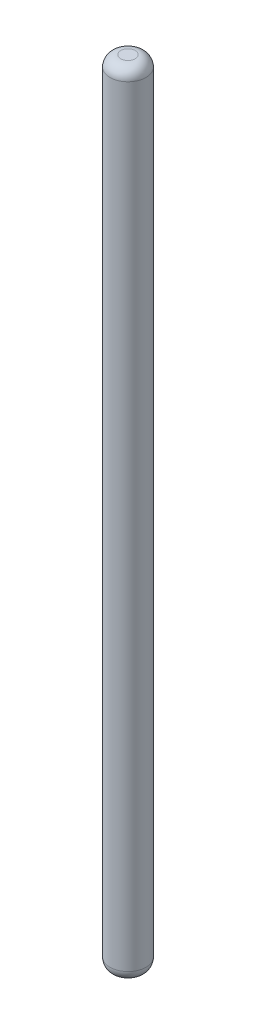
ISO-10303-21;
HEADER;
FILE_DESCRIPTION(('STEP AP214'),'2;1');
FILE_NAME('part.step','',(''),(''),'','','');
FILE_SCHEMA(('AUTOMOTIVE_DESIGN { 1 0 10303 214 1 1 1 1 }'));
ENDSEC;
DATA;
#1=APPLICATION_CONTEXT('core data for automotive mechanical design processes');
#2=APPLICATION_PROTOCOL_DEFINITION('international standard','automotive_design',2000,#1);
#3=PRODUCT_CONTEXT('',#1,'mechanical');
#4=PRODUCT('Part','Part','',(#3));
#5=PRODUCT_RELATED_PRODUCT_CATEGORY('part','',(#4));
#6=PRODUCT_DEFINITION_FORMATION('','',#4);
#7=PRODUCT_DEFINITION_CONTEXT('part definition',#1,'design');
#8=PRODUCT_DEFINITION('design','',#6,#7);
#9=PRODUCT_DEFINITION_SHAPE('','',#8);
#10=(LENGTH_UNIT() NAMED_UNIT(*) SI_UNIT(.MILLI.,.METRE.));
#11=(NAMED_UNIT(*) PLANE_ANGLE_UNIT() SI_UNIT($,.RADIAN.));
#12=(NAMED_UNIT(*) SI_UNIT($,.STERADIAN.) SOLID_ANGLE_UNIT());
#13=UNCERTAINTY_MEASURE_WITH_UNIT(LENGTH_MEASURE(1.E-05),#10,'distance_accuracy_value','');
#14=(GEOMETRIC_REPRESENTATION_CONTEXT(3) GLOBAL_UNCERTAINTY_ASSIGNED_CONTEXT((#13)) GLOBAL_UNIT_ASSIGNED_CONTEXT((#10,
#11,#12)) REPRESENTATION_CONTEXT('',''));
#15=CARTESIAN_POINT('',(0.,0.,0.));
#16=DIRECTION('',(0.,0.,1.));
#17=DIRECTION('',(1.,0.,0.));
#18=AXIS2_PLACEMENT_3D('',#15,#16,#17);
#19=CARTESIAN_POINT('',(0.,110.,0.));
#20=DIRECTION('',(0.,-1.,0.));
#21=DIRECTION('',(0.,0.,-1.));
#22=AXIS2_PLACEMENT_3D('',#19,#20,#21);
#23=CYLINDRICAL_SURFACE('',#22,2.5);
#24=CARTESIAN_POINT('',(0.,1.5,0.));
#25=DIRECTION('',(0.,1.,0.));
#26=DIRECTION('',(0.,0.,1.));
#27=AXIS2_PLACEMENT_3D('',#24,#25,#26);
#28=CIRCLE('',#27,2.5);
#29=CARTESIAN_POINT('',(0.,1.5,2.5));
#30=VERTEX_POINT('',#29);
#31=EDGE_CURVE('E42',#30,#30,#28,.T.);
#32=ORIENTED_EDGE('',*,*,#31,.T.);
#33=EDGE_LOOP('',(#32));
#34=FACE_BOUND('',#33,.T.);
#35=CARTESIAN_POINT('',(0.,108.5,0.));
#36=DIRECTION('',(0.,1.,0.));
#37=DIRECTION('',(0.,0.,1.));
#38=AXIS2_PLACEMENT_3D('',#35,#36,#37);
#39=CIRCLE('',#38,2.5);
#40=CARTESIAN_POINT('',(0.,108.5,2.5));
#41=VERTEX_POINT('',#40);
#42=EDGE_CURVE('E46',#41,#41,#39,.F.);
#43=ORIENTED_EDGE('',*,*,#42,.T.);
#44=EDGE_LOOP('',(#43));
#45=FACE_BOUND('',#44,.T.);
#46=ADVANCED_FACE('F31',(#34,#45),#23,.T.);
#47=CARTESIAN_POINT('',(0.,110.,0.));
#48=DIRECTION('',(0.,1.,0.));
#49=DIRECTION('',(0.,0.,1.));
#50=AXIS2_PLACEMENT_3D('',#47,#48,#49);
#51=PLANE('',#50);
#52=CARTESIAN_POINT('',(0.,110.,0.));
#53=DIRECTION('',(0.,1.,0.));
#54=DIRECTION('',(0.,0.,1.));
#55=AXIS2_PLACEMENT_3D('',#52,#53,#54);
#56=CIRCLE('',#55,1.);
#57=CARTESIAN_POINT('',(0.,110.,1.));
#58=VERTEX_POINT('',#57);
#59=EDGE_CURVE('E10',#58,#58,#56,.T.);
#60=ORIENTED_EDGE('',*,*,#59,.T.);
#61=EDGE_LOOP('',(#60));
#62=FACE_BOUND('',#61,.T.);
#63=ADVANCED_FACE('F62',(#62),#51,.T.);
#64=CARTESIAN_POINT('',(0.,0.,0.));
#65=DIRECTION('',(0.,1.,0.));
#66=DIRECTION('',(0.,0.,1.));
#67=AXIS2_PLACEMENT_3D('',#64,#65,#66);
#68=PLANE('',#67);
#69=CARTESIAN_POINT('',(0.,0.,0.));
#70=DIRECTION('',(0.,1.,0.));
#71=DIRECTION('',(0.,0.,1.));
#72=AXIS2_PLACEMENT_3D('',#69,#70,#71);
#73=CIRCLE('',#72,1.);
#74=CARTESIAN_POINT('',(0.,0.,1.));
#75=VERTEX_POINT('',#74);
#76=EDGE_CURVE('E38',#75,#75,#73,.F.);
#77=ORIENTED_EDGE('',*,*,#76,.T.);
#78=EDGE_LOOP('',(#77));
#79=FACE_BOUND('',#78,.T.);
#80=ADVANCED_FACE('F59',(#79),#68,.F.);
#81=CARTESIAN_POINT('',(0.,1.5,0.));
#82=DIRECTION('',(0.,1.,0.));
#83=DIRECTION('',(0.,0.,1.));
#84=AXIS2_PLACEMENT_3D('',#81,#82,#83);
#85=DEGENERATE_TOROIDAL_SURFACE('',#84,1.,1.5,.T.);
#86=ORIENTED_EDGE('',*,*,#76,.F.);
#87=EDGE_LOOP('',(#86));
#88=FACE_BOUND('',#87,.T.);
#89=ORIENTED_EDGE('',*,*,#31,.F.);
#90=EDGE_LOOP('',(#89));
#91=FACE_BOUND('',#90,.T.);
#92=ADVANCED_FACE('F55',(#88,#91),#85,.T.);
#93=CARTESIAN_POINT('',(0.,108.5,0.));
#94=DIRECTION('',(0.,1.,0.));
#95=DIRECTION('',(0.,0.,1.));
#96=AXIS2_PLACEMENT_3D('',#93,#94,#95);
#97=DEGENERATE_TOROIDAL_SURFACE('',#96,1.,1.5,.T.);
#98=ORIENTED_EDGE('',*,*,#42,.F.);
#99=EDGE_LOOP('',(#98));
#100=FACE_BOUND('',#99,.T.);
#101=ORIENTED_EDGE('',*,*,#59,.F.);
#102=EDGE_LOOP('',(#101));
#103=FACE_BOUND('',#102,.T.);
#104=ADVANCED_FACE('F33',(#100,#103),#97,.T.);
#105=CLOSED_SHELL('',(#46,#63,#80,#92,#104));
#106=MANIFOLD_SOLID_BREP('B2',#105);
#107=ADVANCED_BREP_SHAPE_REPRESENTATION('',(#18,#106),#14);
#108=SHAPE_DEFINITION_REPRESENTATION(#9,#107);
ENDSEC;
END-ISO-10303-21;
